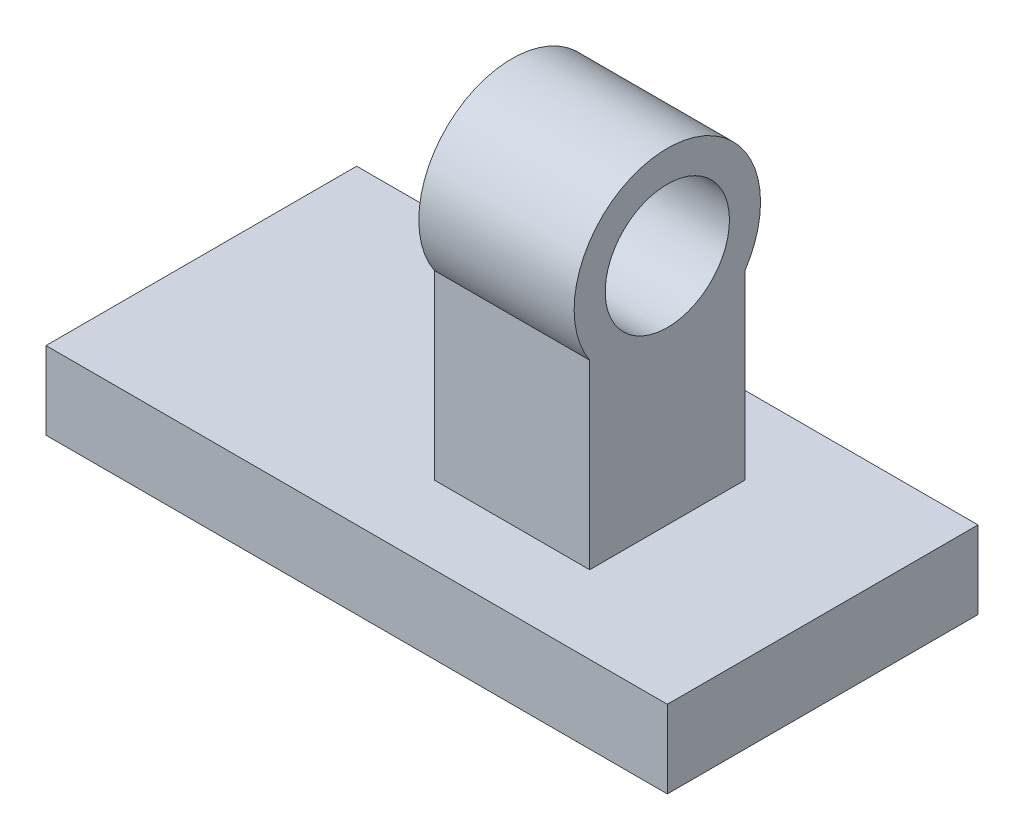
ISO-10303-21;
HEADER;
FILE_DESCRIPTION(('STEP AP214'),'2;1');
FILE_NAME('part.step','',(''),(''),'','','');
FILE_SCHEMA(('AUTOMOTIVE_DESIGN { 1 0 10303 214 1 1 1 1 }'));
ENDSEC;
DATA;
#1=APPLICATION_CONTEXT('core data for automotive mechanical design processes');
#2=APPLICATION_PROTOCOL_DEFINITION('international standard','automotive_design',2000,#1);
#3=PRODUCT_CONTEXT('',#1,'mechanical');
#4=PRODUCT('Part','Part','',(#3));
#5=PRODUCT_RELATED_PRODUCT_CATEGORY('part','',(#4));
#6=PRODUCT_DEFINITION_FORMATION('','',#4);
#7=PRODUCT_DEFINITION_CONTEXT('part definition',#1,'design');
#8=PRODUCT_DEFINITION('design','',#6,#7);
#9=PRODUCT_DEFINITION_SHAPE('','',#8);
#10=(LENGTH_UNIT() NAMED_UNIT(*) SI_UNIT(.MILLI.,.METRE.));
#11=(NAMED_UNIT(*) PLANE_ANGLE_UNIT() SI_UNIT($,.RADIAN.));
#12=(NAMED_UNIT(*) SI_UNIT($,.STERADIAN.) SOLID_ANGLE_UNIT());
#13=UNCERTAINTY_MEASURE_WITH_UNIT(LENGTH_MEASURE(1.E-05),#10,'distance_accuracy_value','');
#14=(GEOMETRIC_REPRESENTATION_CONTEXT(3) GLOBAL_UNCERTAINTY_ASSIGNED_CONTEXT((#13)) GLOBAL_UNIT_ASSIGNED_CONTEXT((#10,
#11,#12)) REPRESENTATION_CONTEXT('',''));
#15=CARTESIAN_POINT('',(0.,0.,0.));
#16=DIRECTION('',(0.,0.,1.));
#17=DIRECTION('',(1.,0.,0.));
#18=AXIS2_PLACEMENT_3D('',#15,#16,#17);
#19=CARTESIAN_POINT('',(100.,-216.043560924236,-266.746524862265));
#20=DIRECTION('',(1.,0.,0.));
#21=DIRECTION('',(0.,0.,-1.));
#22=AXIS2_PLACEMENT_3D('',#19,#20,#21);
#23=PLANE('',#22);
#24=CARTESIAN_POINT('',(100.,-216.043560924236,-266.746524862265));
#25=DIRECTION('',(1.,0.,0.));
#26=DIRECTION('',(0.,0.,-1.));
#27=AXIS2_PLACEMENT_3D('',#24,#25,#26);
#28=CIRCLE('',#27,40.0000000000001);
#29=CARTESIAN_POINT('',(100.,-216.043560924236,-306.746524862265));
#30=VERTEX_POINT('',#29);
#31=EDGE_CURVE('E102',#30,#30,#28,.T.);
#32=ORIENTED_EDGE('',*,*,#31,.F.);
#33=EDGE_LOOP('',(#32));
#34=FACE_BOUND('',#33,.T.);
#35=DIRECTION('',(0.,-1.,0.));
#36=VECTOR('',#35,1.);
#37=CARTESIAN_POINT('',(100.,-249.20980882779,-216.746524862265));
#38=LINE('',#37,#36);
#39=CARTESIAN_POINT('',(100.,-249.20980882779,-216.746524862265));
#40=VERTEX_POINT('',#39);
#41=CARTESIAN_POINT('',(100.,-366.043560924236,-216.746524862265));
#42=VERTEX_POINT('',#41);
#43=EDGE_CURVE('E82',#40,#42,#38,.T.);
#44=ORIENTED_EDGE('',*,*,#43,.T.);
#45=DIRECTION('',(0.,0.,-1.));
#46=VECTOR('',#45,1.);
#47=CARTESIAN_POINT('',(100.,-366.043560924236,-266.746524862265));
#48=LINE('',#47,#46);
#49=CARTESIAN_POINT('',(100.,-366.043560924236,-316.746524862265));
#50=VERTEX_POINT('',#49);
#51=EDGE_CURVE('E85',#42,#50,#48,.T.);
#52=ORIENTED_EDGE('',*,*,#51,.T.);
#53=DIRECTION('',(0.,1.,0.));
#54=VECTOR('',#53,1.);
#55=CARTESIAN_POINT('',(100.,-249.20980882779,-316.746524862265));
#56=LINE('',#55,#54);
#57=CARTESIAN_POINT('',(100.,-249.20980882779,-316.746524862265));
#58=VERTEX_POINT('',#57);
#59=EDGE_CURVE('E56',#50,#58,#56,.T.);
#60=ORIENTED_EDGE('',*,*,#59,.T.);
#61=CARTESIAN_POINT('',(100.,-216.043560924236,-266.746524862265));
#62=DIRECTION('',(1.,0.,0.));
#63=DIRECTION('',(0.,0.,-1.));
#64=AXIS2_PLACEMENT_3D('',#61,#62,#63);
#65=CIRCLE('',#64,60.);
#66=EDGE_CURVE('E88',#58,#40,#65,.T.);
#67=ORIENTED_EDGE('',*,*,#66,.T.);
#68=EDGE_LOOP('',(#44,#52,#60,#67));
#69=FACE_BOUND('',#68,.T.);
#70=ADVANCED_FACE('F39',(#34,#69),#23,.T.);
#71=CARTESIAN_POINT('',(0.,-216.043560924236,-266.746524862265));
#72=DIRECTION('',(1.,0.,0.));
#73=DIRECTION('',(0.,0.,-1.));
#74=AXIS2_PLACEMENT_3D('',#71,#72,#73);
#75=PLANE('',#74);
#76=CARTESIAN_POINT('',(0.,-216.043560924236,-266.746524862265));
#77=DIRECTION('',(1.,0.,0.));
#78=DIRECTION('',(0.,0.,-1.));
#79=AXIS2_PLACEMENT_3D('',#76,#77,#78);
#80=CIRCLE('',#79,40.0000000000001);
#81=CARTESIAN_POINT('',(0.,-216.043560924236,-306.746524862265));
#82=VERTEX_POINT('',#81);
#83=EDGE_CURVE('E99',#82,#82,#80,.T.);
#84=ORIENTED_EDGE('',*,*,#83,.T.);
#85=EDGE_LOOP('',(#84));
#86=FACE_BOUND('',#85,.T.);
#87=DIRECTION('',(0.,0.,-1.));
#88=VECTOR('',#87,1.);
#89=CARTESIAN_POINT('',(0.,-366.043560924236,-266.746524862265));
#90=LINE('',#89,#88);
#91=CARTESIAN_POINT('',(0.,-366.043560924236,-216.746524862265));
#92=VERTEX_POINT('',#91);
#93=CARTESIAN_POINT('',(0.,-366.043560924236,-316.746524862265));
#94=VERTEX_POINT('',#93);
#95=EDGE_CURVE('E75',#92,#94,#90,.T.);
#96=ORIENTED_EDGE('',*,*,#95,.F.);
#97=DIRECTION('',(0.,-1.,0.));
#98=VECTOR('',#97,1.);
#99=CARTESIAN_POINT('',(0.,-249.20980882779,-216.746524862265));
#100=LINE('',#99,#98);
#101=CARTESIAN_POINT('',(0.,-249.20980882779,-216.746524862265));
#102=VERTEX_POINT('',#101);
#103=EDGE_CURVE('E68',#102,#92,#100,.T.);
#104=ORIENTED_EDGE('',*,*,#103,.F.);
#105=CARTESIAN_POINT('',(0.,-216.043560924236,-266.746524862265));
#106=DIRECTION('',(1.,0.,0.));
#107=DIRECTION('',(0.,0.,-1.));
#108=AXIS2_PLACEMENT_3D('',#105,#106,#107);
#109=CIRCLE('',#108,60.);
#110=CARTESIAN_POINT('',(0.,-249.20980882779,-316.746524862265));
#111=VERTEX_POINT('',#110);
#112=EDGE_CURVE('E109',#111,#102,#109,.T.);
#113=ORIENTED_EDGE('',*,*,#112,.F.);
#114=DIRECTION('',(0.,1.,0.));
#115=VECTOR('',#114,1.);
#116=CARTESIAN_POINT('',(0.,-249.20980882779,-316.746524862265));
#117=LINE('',#116,#115);
#118=EDGE_CURVE('E111',#94,#111,#117,.T.);
#119=ORIENTED_EDGE('',*,*,#118,.F.);
#120=EDGE_LOOP('',(#96,#104,#113,#119));
#121=FACE_BOUND('',#120,.T.);
#122=ADVANCED_FACE('F200',(#86,#121),#75,.F.);
#123=CARTESIAN_POINT('',(100.,-216.043560924236,-266.746524862265));
#124=DIRECTION('',(-1.,0.,0.));
#125=DIRECTION('',(0.,0.,1.));
#126=AXIS2_PLACEMENT_3D('',#123,#124,#125);
#127=CYLINDRICAL_SURFACE('',#126,60.);
#128=ORIENTED_EDGE('',*,*,#112,.T.);
#129=DIRECTION('',(-1.,0.,0.));
#130=VECTOR('',#129,1.);
#131=CARTESIAN_POINT('',(100.,-249.20980882779,-216.746524862265));
#132=LINE('',#131,#130);
#133=EDGE_CURVE('E11',#40,#102,#132,.T.);
#134=ORIENTED_EDGE('',*,*,#133,.F.);
#135=ORIENTED_EDGE('',*,*,#66,.F.);
#136=DIRECTION('',(-1.,0.,0.));
#137=VECTOR('',#136,1.);
#138=CARTESIAN_POINT('',(100.,-249.20980882779,-316.746524862265));
#139=LINE('',#138,#137);
#140=EDGE_CURVE('E114',#58,#111,#139,.T.);
#141=ORIENTED_EDGE('',*,*,#140,.T.);
#142=EDGE_LOOP('',(#128,#134,#135,#141));
#143=FACE_BOUND('',#142,.T.);
#144=ADVANCED_FACE('F41',(#143),#127,.T.);
#145=CARTESIAN_POINT('',(100.,-249.20980882779,-216.746524862265));
#146=DIRECTION('',(0.,0.,-1.));
#147=DIRECTION('',(0.,1.,0.));
#148=AXIS2_PLACEMENT_3D('',#145,#146,#147);
#149=PLANE('',#148);
#150=ORIENTED_EDGE('',*,*,#103,.T.);
#151=DIRECTION('',(-1.,0.,0.));
#152=VECTOR('',#151,1.);
#153=CARTESIAN_POINT('',(100.,-366.043560924236,-216.746524862265));
#154=LINE('',#153,#152);
#155=EDGE_CURVE('E48',#42,#92,#154,.T.);
#156=ORIENTED_EDGE('',*,*,#155,.F.);
#157=ORIENTED_EDGE('',*,*,#43,.F.);
#158=ORIENTED_EDGE('',*,*,#133,.T.);
#159=EDGE_LOOP('',(#150,#156,#157,#158));
#160=FACE_BOUND('',#159,.T.);
#161=ADVANCED_FACE('F93',(#160),#149,.F.);
#162=CARTESIAN_POINT('',(100.,-366.043560924236,-166.746524862265));
#163=DIRECTION('',(0.,0.,-1.));
#164=DIRECTION('',(-1.,0.,0.));
#165=AXIS2_PLACEMENT_3D('',#162,#163,#164);
#166=PLANE('',#165);
#167=DIRECTION('',(-1.,0.,0.));
#168=VECTOR('',#167,1.);
#169=CARTESIAN_POINT('',(100.,-366.043560924236,-166.746524862265));
#170=LINE('',#169,#168);
#171=CARTESIAN_POINT('',(200.,-366.043560924236,-166.746524862265));
#172=VERTEX_POINT('',#171);
#173=CARTESIAN_POINT('',(-200.,-366.043560924236,-166.746524862265));
#174=VERTEX_POINT('',#173);
#175=EDGE_CURVE('E95',#172,#174,#170,.T.);
#176=ORIENTED_EDGE('',*,*,#175,.T.);
#177=DIRECTION('',(0.,-1.,0.));
#178=VECTOR('',#177,1.);
#179=CARTESIAN_POINT('',(-200.,-366.043560924236,-166.746524862265));
#180=LINE('',#179,#178);
#181=CARTESIAN_POINT('',(-200.,-416.043560924236,-166.746524862265));
#182=VERTEX_POINT('',#181);
#183=EDGE_CURVE('E142',#174,#182,#180,.T.);
#184=ORIENTED_EDGE('',*,*,#183,.T.);
#185=DIRECTION('',(-1.,0.,0.));
#186=VECTOR('',#185,1.);
#187=CARTESIAN_POINT('',(100.,-416.043560924236,-166.746524862265));
#188=LINE('',#187,#186);
#189=CARTESIAN_POINT('',(200.,-416.043560924236,-166.746524862265));
#190=VERTEX_POINT('',#189);
#191=EDGE_CURVE('E128',#190,#182,#188,.T.);
#192=ORIENTED_EDGE('',*,*,#191,.F.);
#193=DIRECTION('',(0.,-1.,0.));
#194=VECTOR('',#193,1.);
#195=CARTESIAN_POINT('',(200.,-366.043560924236,-166.746524862265));
#196=LINE('',#195,#194);
#197=EDGE_CURVE('E146',#172,#190,#196,.T.);
#198=ORIENTED_EDGE('',*,*,#197,.F.);
#199=EDGE_LOOP('',(#176,#184,#192,#198));
#200=FACE_BOUND('',#199,.T.);
#201=ADVANCED_FACE('F138',(#200),#166,.F.);
#202=CARTESIAN_POINT('',(100.,-416.043560924236,-166.746524862265));
#203=DIRECTION('',(0.,1.,0.));
#204=DIRECTION('',(0.,0.,1.));
#205=AXIS2_PLACEMENT_3D('',#202,#203,#204);
#206=PLANE('',#205);
#207=ORIENTED_EDGE('',*,*,#191,.T.);
#208=DIRECTION('',(0.,0.,1.));
#209=VECTOR('',#208,1.);
#210=CARTESIAN_POINT('',(-200.,-416.043560924236,-366.746524862265));
#211=LINE('',#210,#209);
#212=CARTESIAN_POINT('',(-200.,-416.043560924236,-366.746524862265));
#213=VERTEX_POINT('',#212);
#214=EDGE_CURVE('E162',#213,#182,#211,.T.);
#215=ORIENTED_EDGE('',*,*,#214,.F.);
#216=DIRECTION('',(-1.,0.,0.));
#217=VECTOR('',#216,1.);
#218=CARTESIAN_POINT('',(100.,-416.043560924236,-366.746524862265));
#219=LINE('',#218,#217);
#220=CARTESIAN_POINT('',(200.,-416.043560924236,-366.746524862265));
#221=VERTEX_POINT('',#220);
#222=EDGE_CURVE('E125',#221,#213,#219,.T.);
#223=ORIENTED_EDGE('',*,*,#222,.F.);
#224=DIRECTION('',(0.,0.,1.));
#225=VECTOR('',#224,1.);
#226=CARTESIAN_POINT('',(200.,-416.043560924236,-366.746524862265));
#227=LINE('',#226,#225);
#228=EDGE_CURVE('E166',#221,#190,#227,.T.);
#229=ORIENTED_EDGE('',*,*,#228,.T.);
#230=EDGE_LOOP('',(#207,#215,#223,#229));
#231=FACE_BOUND('',#230,.T.);
#232=ADVANCED_FACE('F190',(#231),#206,.F.);
#233=CARTESIAN_POINT('',(100.,-366.043560924236,-366.746524862265));
#234=DIRECTION('',(0.,0.,1.));
#235=DIRECTION('',(1.,0.,0.));
#236=AXIS2_PLACEMENT_3D('',#233,#234,#235);
#237=PLANE('',#236);
#238=ORIENTED_EDGE('',*,*,#222,.T.);
#239=DIRECTION('',(0.,-1.,0.));
#240=VECTOR('',#239,1.);
#241=CARTESIAN_POINT('',(-200.,-366.043560924236,-366.746524862265));
#242=LINE('',#241,#240);
#243=CARTESIAN_POINT('',(-200.,-366.043560924236,-366.746524862265));
#244=VERTEX_POINT('',#243);
#245=EDGE_CURVE('E158',#244,#213,#242,.T.);
#246=ORIENTED_EDGE('',*,*,#245,.F.);
#247=DIRECTION('',(-1.,0.,0.));
#248=VECTOR('',#247,1.);
#249=CARTESIAN_POINT('',(100.,-366.043560924236,-366.746524862265));
#250=LINE('',#249,#248);
#251=CARTESIAN_POINT('',(200.,-366.043560924236,-366.746524862265));
#252=VERTEX_POINT('',#251);
#253=EDGE_CURVE('E122',#252,#244,#250,.T.);
#254=ORIENTED_EDGE('',*,*,#253,.F.);
#255=DIRECTION('',(0.,-1.,0.));
#256=VECTOR('',#255,1.);
#257=CARTESIAN_POINT('',(200.,-366.043560924236,-366.746524862265));
#258=LINE('',#257,#256);
#259=EDGE_CURVE('E104',#252,#221,#258,.T.);
#260=ORIENTED_EDGE('',*,*,#259,.T.);
#261=EDGE_LOOP('',(#238,#246,#254,#260));
#262=FACE_BOUND('',#261,.T.);
#263=ADVANCED_FACE('F180',(#262),#237,.F.);
#264=CARTESIAN_POINT('',(100.,-366.043560924236,-316.746524862265));
#265=DIRECTION('',(0.,-1.,0.));
#266=DIRECTION('',(0.,0.,-1.));
#267=AXIS2_PLACEMENT_3D('',#264,#265,#266);
#268=PLANE('',#267);
#269=ORIENTED_EDGE('',*,*,#175,.F.);
#270=DIRECTION('',(0.,0.,1.));
#271=VECTOR('',#270,1.);
#272=CARTESIAN_POINT('',(200.,-366.043560924236,-366.746524862265));
#273=LINE('',#272,#271);
#274=EDGE_CURVE('E174',#252,#172,#273,.T.);
#275=ORIENTED_EDGE('',*,*,#274,.F.);
#276=ORIENTED_EDGE('',*,*,#253,.T.);
#277=DIRECTION('',(0.,0.,1.));
#278=VECTOR('',#277,1.);
#279=CARTESIAN_POINT('',(-200.,-366.043560924236,-366.746524862265));
#280=LINE('',#279,#278);
#281=EDGE_CURVE('E153',#244,#174,#280,.T.);
#282=ORIENTED_EDGE('',*,*,#281,.T.);
#283=EDGE_LOOP('',(#269,#275,#276,#282));
#284=FACE_BOUND('',#283,.T.);
#285=ORIENTED_EDGE('',*,*,#51,.F.);
#286=ORIENTED_EDGE('',*,*,#155,.T.);
#287=ORIENTED_EDGE('',*,*,#95,.T.);
#288=DIRECTION('',(-1.,0.,0.));
#289=VECTOR('',#288,1.);
#290=CARTESIAN_POINT('',(100.,-366.043560924236,-316.746524862265));
#291=LINE('',#290,#289);
#292=EDGE_CURVE('E98',#50,#94,#291,.T.);
#293=ORIENTED_EDGE('',*,*,#292,.F.);
#294=EDGE_LOOP('',(#285,#286,#287,#293));
#295=FACE_BOUND('',#294,.T.);
#296=ADVANCED_FACE('F96',(#284,#295),#268,.F.);
#297=CARTESIAN_POINT('',(100.,-249.20980882779,-316.746524862265));
#298=DIRECTION('',(0.,0.,1.));
#299=DIRECTION('',(1.,0.,0.));
#300=AXIS2_PLACEMENT_3D('',#297,#298,#299);
#301=PLANE('',#300);
#302=ORIENTED_EDGE('',*,*,#118,.T.);
#303=ORIENTED_EDGE('',*,*,#140,.F.);
#304=ORIENTED_EDGE('',*,*,#59,.F.);
#305=ORIENTED_EDGE('',*,*,#292,.T.);
#306=EDGE_LOOP('',(#302,#303,#304,#305));
#307=FACE_BOUND('',#306,.T.);
#308=ADVANCED_FACE('F213',(#307),#301,.F.);
#309=CARTESIAN_POINT('',(100.,-216.043560924236,-266.746524862265));
#310=DIRECTION('',(-1.,0.,0.));
#311=DIRECTION('',(0.,0.,1.));
#312=AXIS2_PLACEMENT_3D('',#309,#310,#311);
#313=CYLINDRICAL_SURFACE('',#312,40.0000000000001);
#314=ORIENTED_EDGE('',*,*,#31,.T.);
#315=EDGE_LOOP('',(#314));
#316=FACE_BOUND('',#315,.T.);
#317=ORIENTED_EDGE('',*,*,#83,.F.);
#318=EDGE_LOOP('',(#317));
#319=FACE_BOUND('',#318,.T.);
#320=ADVANCED_FACE('F210',(#316,#319),#313,.F.);
#321=CARTESIAN_POINT('',(-200.,0.,0.));
#322=DIRECTION('',(1.,0.,0.));
#323=DIRECTION('',(0.,0.,-1.));
#324=AXIS2_PLACEMENT_3D('',#321,#322,#323);
#325=PLANE('',#324);
#326=ORIENTED_EDGE('',*,*,#214,.T.);
#327=ORIENTED_EDGE('',*,*,#183,.F.);
#328=ORIENTED_EDGE('',*,*,#281,.F.);
#329=ORIENTED_EDGE('',*,*,#245,.T.);
#330=EDGE_LOOP('',(#326,#327,#328,#329));
#331=FACE_BOUND('',#330,.T.);
#332=ADVANCED_FACE('F160',(#331),#325,.F.);
#333=CARTESIAN_POINT('',(200.,0.,0.));
#334=DIRECTION('',(1.,0.,0.));
#335=DIRECTION('',(0.,0.,-1.));
#336=AXIS2_PLACEMENT_3D('',#333,#334,#335);
#337=PLANE('',#336);
#338=ORIENTED_EDGE('',*,*,#228,.F.);
#339=ORIENTED_EDGE('',*,*,#259,.F.);
#340=ORIENTED_EDGE('',*,*,#274,.T.);
#341=ORIENTED_EDGE('',*,*,#197,.T.);
#342=EDGE_LOOP('',(#338,#339,#340,#341));
#343=FACE_BOUND('',#342,.T.);
#344=ADVANCED_FACE('F184',(#343),#337,.T.);
#345=CLOSED_SHELL('',(#70,#122,#144,#161,#201,#232,#263,#296,#308,#320,#332,#344));
#346=MANIFOLD_SOLID_BREP('B2',#345);
#347=ADVANCED_BREP_SHAPE_REPRESENTATION('',(#18,#346),#14);
#348=SHAPE_DEFINITION_REPRESENTATION(#9,#347);
ENDSEC;
END-ISO-10303-21;
